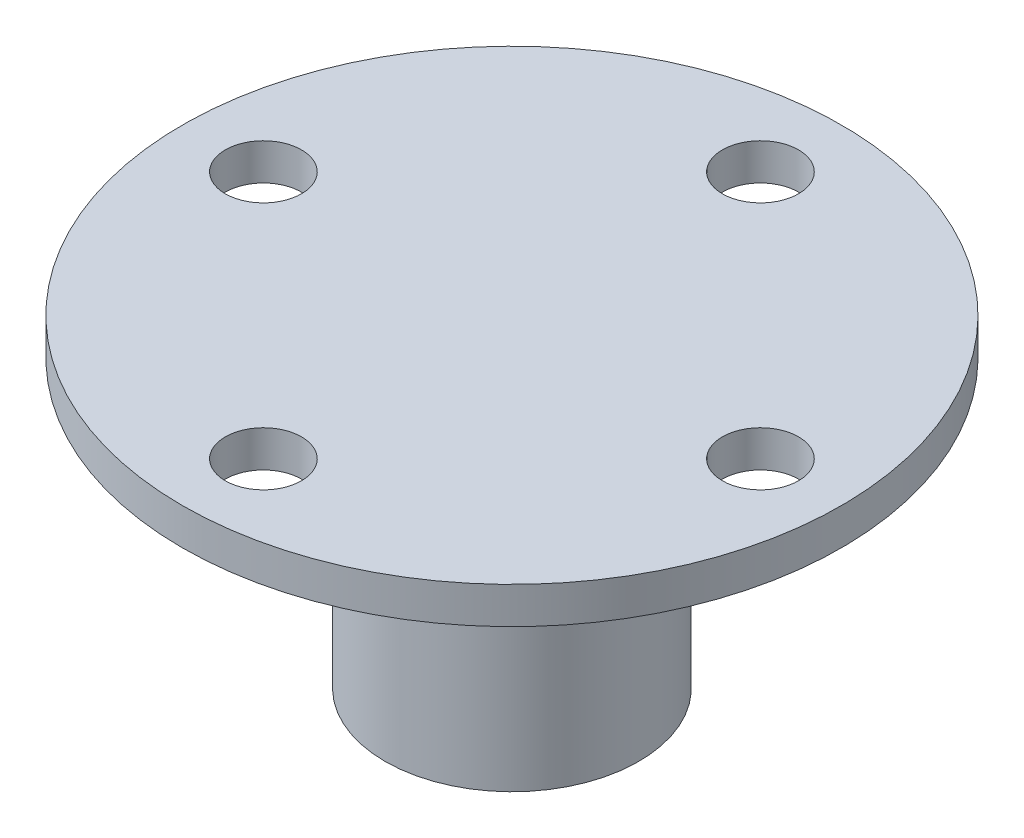
ISO-10303-21;
HEADER;
FILE_DESCRIPTION(('STEP AP214'),'2;1');
FILE_NAME('part.step','',(''),(''),'','','');
FILE_SCHEMA(('AUTOMOTIVE_DESIGN { 1 0 10303 214 1 1 1 1 }'));
ENDSEC;
DATA;
#1=APPLICATION_CONTEXT('core data for automotive mechanical design processes');
#2=APPLICATION_PROTOCOL_DEFINITION('international standard','automotive_design',2000,#1);
#3=PRODUCT_CONTEXT('',#1,'mechanical');
#4=PRODUCT('Part','Part','',(#3));
#5=PRODUCT_RELATED_PRODUCT_CATEGORY('part','',(#4));
#6=PRODUCT_DEFINITION_FORMATION('','',#4);
#7=PRODUCT_DEFINITION_CONTEXT('part definition',#1,'design');
#8=PRODUCT_DEFINITION('design','',#6,#7);
#9=PRODUCT_DEFINITION_SHAPE('','',#8);
#10=(LENGTH_UNIT() NAMED_UNIT(*) SI_UNIT(.MILLI.,.METRE.));
#11=(NAMED_UNIT(*) PLANE_ANGLE_UNIT() SI_UNIT($,.RADIAN.));
#12=(NAMED_UNIT(*) SI_UNIT($,.STERADIAN.) SOLID_ANGLE_UNIT());
#13=UNCERTAINTY_MEASURE_WITH_UNIT(LENGTH_MEASURE(1.E-05),#10,'distance_accuracy_value','');
#14=(GEOMETRIC_REPRESENTATION_CONTEXT(3) GLOBAL_UNCERTAINTY_ASSIGNED_CONTEXT((#13)) GLOBAL_UNIT_ASSIGNED_CONTEXT((#10,
#11,#12)) REPRESENTATION_CONTEXT('',''));
#15=CARTESIAN_POINT('',(0.,0.,0.));
#16=DIRECTION('',(0.,0.,1.));
#17=DIRECTION('',(1.,0.,0.));
#18=AXIS2_PLACEMENT_3D('',#15,#16,#17);
#19=CARTESIAN_POINT('',(0.,3.175,21.548));
#20=DIRECTION('',(0.,-1.,0.));
#21=DIRECTION('',(0.,0.,-1.));
#22=AXIS2_PLACEMENT_3D('',#19,#20,#21);
#23=CYLINDRICAL_SURFACE('',#22,3.302);
#24=CARTESIAN_POINT('',(0.,3.175,21.548));
#25=DIRECTION('',(0.,1.,0.));
#26=DIRECTION('',(0.,0.,1.));
#27=AXIS2_PLACEMENT_3D('',#24,#25,#26);
#28=CIRCLE('',#27,3.302);
#29=CARTESIAN_POINT('',(0.,3.175,24.85));
#30=VERTEX_POINT('',#29);
#31=EDGE_CURVE('E155',#30,#30,#28,.T.);
#32=ORIENTED_EDGE('',*,*,#31,.T.);
#33=EDGE_LOOP('',(#32));
#34=FACE_BOUND('',#33,.T.);
#35=CARTESIAN_POINT('',(0.,0.,21.548));
#36=DIRECTION('',(0.,1.,0.));
#37=DIRECTION('',(0.,0.,1.));
#38=AXIS2_PLACEMENT_3D('',#35,#36,#37);
#39=CIRCLE('',#38,3.302);
#40=CARTESIAN_POINT('',(0.,0.,24.85));
#41=VERTEX_POINT('',#40);
#42=EDGE_CURVE('E174',#41,#41,#39,.T.);
#43=ORIENTED_EDGE('',*,*,#42,.F.);
#44=EDGE_LOOP('',(#43));
#45=FACE_BOUND('',#44,.T.);
#46=ADVANCED_FACE('F46',(#34,#45),#23,.F.);
#47=CARTESIAN_POINT('',(-21.548,3.175,-1.50468879778784E-13));
#48=DIRECTION('',(0.,-1.,0.));
#49=DIRECTION('',(0.,0.,-1.));
#50=AXIS2_PLACEMENT_3D('',#47,#48,#49);
#51=CYLINDRICAL_SURFACE('',#50,3.302);
#52=CARTESIAN_POINT('',(-21.548,3.175,-1.50468879778784E-13));
#53=DIRECTION('',(0.,1.,0.));
#54=DIRECTION('',(0.,0.,1.));
#55=AXIS2_PLACEMENT_3D('',#52,#53,#54);
#56=CIRCLE('',#55,3.302);
#57=CARTESIAN_POINT('',(-21.548,3.175,3.30199999999985));
#58=VERTEX_POINT('',#57);
#59=EDGE_CURVE('E151',#58,#58,#56,.T.);
#60=ORIENTED_EDGE('',*,*,#59,.T.);
#61=EDGE_LOOP('',(#60));
#62=FACE_BOUND('',#61,.T.);
#63=CARTESIAN_POINT('',(-21.548,0.,-1.50468879778784E-13));
#64=DIRECTION('',(0.,1.,0.));
#65=DIRECTION('',(0.,0.,1.));
#66=AXIS2_PLACEMENT_3D('',#63,#64,#65);
#67=CIRCLE('',#66,3.302);
#68=CARTESIAN_POINT('',(-21.548,0.,3.30199999999985));
#69=VERTEX_POINT('',#68);
#70=EDGE_CURVE('E170',#69,#69,#67,.T.);
#71=ORIENTED_EDGE('',*,*,#70,.F.);
#72=EDGE_LOOP('',(#71));
#73=FACE_BOUND('',#72,.T.);
#74=ADVANCED_FACE('F197',(#62,#73),#51,.F.);
#75=CARTESIAN_POINT('',(2.25703319668175E-13,3.175,-21.548));
#76=DIRECTION('',(0.,-1.,0.));
#77=DIRECTION('',(0.,0.,-1.));
#78=AXIS2_PLACEMENT_3D('',#75,#76,#77);
#79=CYLINDRICAL_SURFACE('',#78,3.302);
#80=CARTESIAN_POINT('',(2.25703319668175E-13,3.175,-21.548));
#81=DIRECTION('',(0.,1.,0.));
#82=DIRECTION('',(0.,0.,1.));
#83=AXIS2_PLACEMENT_3D('',#80,#81,#82);
#84=CIRCLE('',#83,3.302);
#85=CARTESIAN_POINT('',(2.25703319668175E-13,3.175,-18.246));
#86=VERTEX_POINT('',#85);
#87=EDGE_CURVE('E146',#86,#86,#84,.T.);
#88=ORIENTED_EDGE('',*,*,#87,.T.);
#89=EDGE_LOOP('',(#88));
#90=FACE_BOUND('',#89,.T.);
#91=CARTESIAN_POINT('',(2.25703319668175E-13,0.,-21.548));
#92=DIRECTION('',(0.,1.,0.));
#93=DIRECTION('',(0.,0.,1.));
#94=AXIS2_PLACEMENT_3D('',#91,#92,#93);
#95=CIRCLE('',#94,3.302);
#96=CARTESIAN_POINT('',(2.25703319668175E-13,0.,-18.246));
#97=VERTEX_POINT('',#96);
#98=EDGE_CURVE('E166',#97,#97,#95,.T.);
#99=ORIENTED_EDGE('',*,*,#98,.F.);
#100=EDGE_LOOP('',(#99));
#101=FACE_BOUND('',#100,.T.);
#102=ADVANCED_FACE('F203',(#90,#101),#79,.F.);
#103=CARTESIAN_POINT('',(21.548,3.175,0.));
#104=DIRECTION('',(0.,-1.,0.));
#105=DIRECTION('',(0.,0.,-1.));
#106=AXIS2_PLACEMENT_3D('',#103,#104,#105);
#107=CYLINDRICAL_SURFACE('',#106,3.302);
#108=CARTESIAN_POINT('',(21.548,3.175,0.));
#109=DIRECTION('',(0.,1.,0.));
#110=DIRECTION('',(0.,0.,1.));
#111=AXIS2_PLACEMENT_3D('',#108,#109,#110);
#112=CIRCLE('',#111,3.302);
#113=CARTESIAN_POINT('',(21.548,3.175,3.302));
#114=VERTEX_POINT('',#113);
#115=EDGE_CURVE('E142',#114,#114,#112,.T.);
#116=ORIENTED_EDGE('',*,*,#115,.T.);
#117=EDGE_LOOP('',(#116));
#118=FACE_BOUND('',#117,.T.);
#119=CARTESIAN_POINT('',(21.548,0.,0.));
#120=DIRECTION('',(0.,1.,0.));
#121=DIRECTION('',(0.,0.,1.));
#122=AXIS2_PLACEMENT_3D('',#119,#120,#121);
#123=CIRCLE('',#122,3.302);
#124=CARTESIAN_POINT('',(21.548,0.,3.302));
#125=VERTEX_POINT('',#124);
#126=EDGE_CURVE('E136',#125,#125,#123,.T.);
#127=ORIENTED_EDGE('',*,*,#126,.F.);
#128=EDGE_LOOP('',(#127));
#129=FACE_BOUND('',#128,.T.);
#130=ADVANCED_FACE('F211',(#118,#129),#107,.F.);
#131=CARTESIAN_POINT('',(0.,3.175,0.));
#132=DIRECTION('',(0.,-1.,0.));
#133=DIRECTION('',(0.,0.,-1.));
#134=AXIS2_PLACEMENT_3D('',#131,#132,#133);
#135=CYLINDRICAL_SURFACE('',#134,28.575);
#136=CARTESIAN_POINT('',(0.,3.175,0.));
#137=DIRECTION('',(0.,1.,0.));
#138=DIRECTION('',(0.,0.,1.));
#139=AXIS2_PLACEMENT_3D('',#136,#137,#138);
#140=CIRCLE('',#139,28.575);
#141=CARTESIAN_POINT('',(0.,3.175,28.575));
#142=VERTEX_POINT('',#141);
#143=EDGE_CURVE('E159',#142,#142,#140,.T.);
#144=ORIENTED_EDGE('',*,*,#143,.F.);
#145=EDGE_LOOP('',(#144));
#146=FACE_BOUND('',#145,.T.);
#147=CARTESIAN_POINT('',(0.,0.,0.));
#148=DIRECTION('',(0.,1.,0.));
#149=DIRECTION('',(0.,0.,1.));
#150=AXIS2_PLACEMENT_3D('',#147,#148,#149);
#151=CIRCLE('',#150,28.575);
#152=CARTESIAN_POINT('',(0.,0.,28.575));
#153=VERTEX_POINT('',#152);
#154=EDGE_CURVE('E147',#153,#153,#151,.T.);
#155=ORIENTED_EDGE('',*,*,#154,.T.);
#156=EDGE_LOOP('',(#155));
#157=FACE_BOUND('',#156,.T.);
#158=ADVANCED_FACE('F208',(#146,#157),#135,.T.);
#159=CARTESIAN_POINT('',(0.,3.175,0.));
#160=DIRECTION('',(0.,1.,0.));
#161=DIRECTION('',(0.,0.,1.));
#162=AXIS2_PLACEMENT_3D('',#159,#160,#161);
#163=PLANE('',#162);
#164=ORIENTED_EDGE('',*,*,#115,.F.);
#165=EDGE_LOOP('',(#164));
#166=FACE_BOUND('',#165,.T.);
#167=ORIENTED_EDGE('',*,*,#87,.F.);
#168=EDGE_LOOP('',(#167));
#169=FACE_BOUND('',#168,.T.);
#170=ORIENTED_EDGE('',*,*,#59,.F.);
#171=EDGE_LOOP('',(#170));
#172=FACE_BOUND('',#171,.T.);
#173=ORIENTED_EDGE('',*,*,#31,.F.);
#174=EDGE_LOOP('',(#173));
#175=FACE_BOUND('',#174,.T.);
#176=ORIENTED_EDGE('',*,*,#143,.T.);
#177=EDGE_LOOP('',(#176));
#178=FACE_BOUND('',#177,.T.);
#179=ADVANCED_FACE('F218',(#166,#169,#172,#175,#178),#163,.T.);
#180=CARTESIAN_POINT('',(0.,0.,0.));
#181=DIRECTION('',(0.,1.,0.));
#182=DIRECTION('',(0.,0.,1.));
#183=AXIS2_PLACEMENT_3D('',#180,#181,#182);
#184=PLANE('',#183);
#185=CARTESIAN_POINT('',(0.,0.,0.));
#186=DIRECTION('',(0.,1.,0.));
#187=DIRECTION('',(0.,0.,1.));
#188=AXIS2_PLACEMENT_3D('',#185,#186,#187);
#189=CIRCLE('',#188,16.);
#190=CARTESIAN_POINT('',(0.,0.,16.));
#191=VERTEX_POINT('',#190);
#192=EDGE_CURVE('E55',#191,#191,#189,.T.);
#193=ORIENTED_EDGE('',*,*,#192,.T.);
#194=EDGE_LOOP('',(#193));
#195=FACE_BOUND('',#194,.T.);
#196=ORIENTED_EDGE('',*,*,#126,.T.);
#197=EDGE_LOOP('',(#196));
#198=FACE_BOUND('',#197,.T.);
#199=ORIENTED_EDGE('',*,*,#98,.T.);
#200=EDGE_LOOP('',(#199));
#201=FACE_BOUND('',#200,.T.);
#202=ORIENTED_EDGE('',*,*,#70,.T.);
#203=EDGE_LOOP('',(#202));
#204=FACE_BOUND('',#203,.T.);
#205=ORIENTED_EDGE('',*,*,#42,.T.);
#206=EDGE_LOOP('',(#205));
#207=FACE_BOUND('',#206,.T.);
#208=ORIENTED_EDGE('',*,*,#154,.F.);
#209=EDGE_LOOP('',(#208));
#210=FACE_BOUND('',#209,.T.);
#211=ADVANCED_FACE('F184',(#195,#198,#201,#204,#207,#210),#184,.F.);
#212=CARTESIAN_POINT('',(0.,-24.825,0.));
#213=DIRECTION('',(0.,1.,0.));
#214=DIRECTION('',(0.,0.,1.));
#215=AXIS2_PLACEMENT_3D('',#212,#213,#214);
#216=CYLINDRICAL_SURFACE('',#215,6.);
#217=CARTESIAN_POINT('',(0.,0.,0.));
#218=DIRECTION('',(0.,1.,0.));
#219=DIRECTION('',(0.,0.,1.));
#220=AXIS2_PLACEMENT_3D('',#217,#218,#219);
#221=CIRCLE('',#220,6.);
#222=CARTESIAN_POINT('',(-2.5857864376269,0.,5.4142135623731));
#223=VERTEX_POINT('',#222);
#224=CARTESIAN_POINT('',(-5.41421356237311,0.,2.58578643762691));
#225=VERTEX_POINT('',#224);
#226=EDGE_CURVE('E125',#223,#225,#221,.T.);
#227=ORIENTED_EDGE('',*,*,#226,.T.);
#228=DIRECTION('',(0.,1.,0.));
#229=VECTOR('',#228,1.);
#230=CARTESIAN_POINT('',(-5.41421356237311,-24.825,2.58578643762691));
#231=LINE('',#230,#229);
#232=CARTESIAN_POINT('',(-5.41421356237311,-24.825,2.58578643762691));
#233=VERTEX_POINT('',#232);
#234=EDGE_CURVE('E112',#233,#225,#231,.T.);
#235=ORIENTED_EDGE('',*,*,#234,.F.);
#236=CARTESIAN_POINT('',(0.,-24.825,0.));
#237=DIRECTION('',(0.,1.,0.));
#238=DIRECTION('',(0.,0.,1.));
#239=AXIS2_PLACEMENT_3D('',#236,#237,#238);
#240=CIRCLE('',#239,6.);
#241=CARTESIAN_POINT('',(-2.5857864376269,-24.825,5.4142135623731));
#242=VERTEX_POINT('',#241);
#243=EDGE_CURVE('E91',#242,#233,#240,.T.);
#244=ORIENTED_EDGE('',*,*,#243,.F.);
#245=DIRECTION('',(0.,1.,0.));
#246=VECTOR('',#245,1.);
#247=CARTESIAN_POINT('',(-2.5857864376269,-24.825,5.4142135623731));
#248=LINE('',#247,#246);
#249=EDGE_CURVE('E102',#242,#223,#248,.T.);
#250=ORIENTED_EDGE('',*,*,#249,.T.);
#251=EDGE_LOOP('',(#227,#235,#244,#250));
#252=FACE_BOUND('',#251,.T.);
#253=ADVANCED_FACE('F111',(#252),#216,.F.);
#254=CARTESIAN_POINT('',(-1.41421356237311,-24.825,-1.4142135623731));
#255=DIRECTION('',(0.707106781186548,0.,0.707106781186547));
#256=DIRECTION('',(0.707106781186547,0.,-0.707106781186548));
#257=AXIS2_PLACEMENT_3D('',#254,#255,#256);
#258=PLANE('',#257);
#259=DIRECTION('',(0.707106781186547,0.,-0.707106781186548));
#260=VECTOR('',#259,1.);
#261=CARTESIAN_POINT('',(-1.41421356237311,0.,-1.4142135623731));
#262=LINE('',#261,#260);
#263=CARTESIAN_POINT('',(-6.71751442127221,0.,3.88908729652601));
#264=VERTEX_POINT('',#263);
#265=EDGE_CURVE('E62',#264,#225,#262,.T.);
#266=ORIENTED_EDGE('',*,*,#265,.F.);
#267=DIRECTION('',(0.,1.,0.));
#268=VECTOR('',#267,1.);
#269=CARTESIAN_POINT('',(-6.71751442127221,-24.825,3.88908729652601));
#270=LINE('',#269,#268);
#271=CARTESIAN_POINT('',(-6.71751442127221,-24.825,3.88908729652601));
#272=VERTEX_POINT('',#271);
#273=EDGE_CURVE('E137',#272,#264,#270,.T.);
#274=ORIENTED_EDGE('',*,*,#273,.F.);
#275=DIRECTION('',(0.707106781186547,0.,-0.707106781186548));
#276=VECTOR('',#275,1.);
#277=CARTESIAN_POINT('',(-1.41421356237311,-24.825,-1.4142135623731));
#278=LINE('',#277,#276);
#279=EDGE_CURVE('E109',#272,#233,#278,.T.);
#280=ORIENTED_EDGE('',*,*,#279,.T.);
#281=ORIENTED_EDGE('',*,*,#234,.T.);
#282=EDGE_LOOP('',(#266,#274,#280,#281));
#283=FACE_BOUND('',#282,.T.);
#284=ADVANCED_FACE('F238',(#283),#258,.T.);
#285=CARTESIAN_POINT('',(-5.30330085889909,-24.825,5.30330085889912));
#286=DIRECTION('',(-0.707106781186546,0.,0.707106781186549));
#287=DIRECTION('',(0.707106781186549,0.,0.707106781186546));
#288=AXIS2_PLACEMENT_3D('',#285,#286,#287);
#289=PLANE('',#288);
#290=DIRECTION('',(0.707106781186549,0.,0.707106781186546));
#291=VECTOR('',#290,1.);
#292=CARTESIAN_POINT('',(-5.30330085889909,0.,5.30330085889912));
#293=LINE('',#292,#291);
#294=CARTESIAN_POINT('',(-3.88908729652601,0.,6.7175144212722));
#295=VERTEX_POINT('',#294);
#296=EDGE_CURVE('E67',#264,#295,#293,.T.);
#297=ORIENTED_EDGE('',*,*,#296,.T.);
#298=DIRECTION('',(0.,1.,0.));
#299=VECTOR('',#298,1.);
#300=CARTESIAN_POINT('',(-3.88908729652601,-24.825,6.7175144212722));
#301=LINE('',#300,#299);
#302=CARTESIAN_POINT('',(-3.88908729652601,-24.825,6.7175144212722));
#303=VERTEX_POINT('',#302);
#304=EDGE_CURVE('E108',#303,#295,#301,.T.);
#305=ORIENTED_EDGE('',*,*,#304,.F.);
#306=DIRECTION('',(0.707106781186549,0.,0.707106781186546));
#307=VECTOR('',#306,1.);
#308=CARTESIAN_POINT('',(-5.30330085889909,-24.825,5.30330085889912));
#309=LINE('',#308,#307);
#310=EDGE_CURVE('E94',#272,#303,#309,.T.);
#311=ORIENTED_EDGE('',*,*,#310,.F.);
#312=ORIENTED_EDGE('',*,*,#273,.T.);
#313=EDGE_LOOP('',(#297,#305,#311,#312));
#314=FACE_BOUND('',#313,.T.);
#315=ADVANCED_FACE('F245',(#314),#289,.F.);
#316=CARTESIAN_POINT('',(0.,-24.825,0.));
#317=DIRECTION('',(0.,1.,0.));
#318=DIRECTION('',(0.,0.,1.));
#319=AXIS2_PLACEMENT_3D('',#316,#317,#318);
#320=CYLINDRICAL_SURFACE('',#319,11.);
#321=CARTESIAN_POINT('',(0.,-5.,0.));
#322=DIRECTION('',(0.,1.,0.));
#323=DIRECTION('',(0.,0.,1.));
#324=AXIS2_PLACEMENT_3D('',#321,#322,#323);
#325=CIRCLE('',#324,11.);
#326=CARTESIAN_POINT('',(0.,-5.,11.));
#327=VERTEX_POINT('',#326);
#328=EDGE_CURVE('E11',#327,#327,#325,.F.);
#329=ORIENTED_EDGE('',*,*,#328,.T.);
#330=EDGE_LOOP('',(#329));
#331=FACE_BOUND('',#330,.T.);
#332=CARTESIAN_POINT('',(0.,-24.825,0.));
#333=DIRECTION('',(0.,1.,0.));
#334=DIRECTION('',(0.,0.,1.));
#335=AXIS2_PLACEMENT_3D('',#332,#333,#334);
#336=CIRCLE('',#335,11.);
#337=CARTESIAN_POINT('',(0.,-24.825,11.));
#338=VERTEX_POINT('',#337);
#339=EDGE_CURVE('E115',#338,#338,#336,.T.);
#340=ORIENTED_EDGE('',*,*,#339,.T.);
#341=EDGE_LOOP('',(#340));
#342=FACE_BOUND('',#341,.T.);
#343=ADVANCED_FACE('F244',(#331,#342),#320,.T.);
#344=CARTESIAN_POINT('',(1.4142135623731,-24.825,1.4142135623731));
#345=DIRECTION('',(0.707106781186547,0.,0.707106781186548));
#346=DIRECTION('',(0.707106781186548,0.,-0.707106781186547));
#347=AXIS2_PLACEMENT_3D('',#344,#345,#346);
#348=PLANE('',#347);
#349=DIRECTION('',(0.707106781186548,0.,-0.707106781186547));
#350=VECTOR('',#349,1.);
#351=CARTESIAN_POINT('',(1.4142135623731,0.,1.4142135623731));
#352=LINE('',#351,#350);
#353=EDGE_CURVE('E104',#295,#223,#352,.T.);
#354=ORIENTED_EDGE('',*,*,#353,.T.);
#355=ORIENTED_EDGE('',*,*,#249,.F.);
#356=DIRECTION('',(0.707106781186548,0.,-0.707106781186547));
#357=VECTOR('',#356,1.);
#358=CARTESIAN_POINT('',(1.4142135623731,-24.825,1.4142135623731));
#359=LINE('',#358,#357);
#360=EDGE_CURVE('E86',#303,#242,#359,.T.);
#361=ORIENTED_EDGE('',*,*,#360,.F.);
#362=ORIENTED_EDGE('',*,*,#304,.T.);
#363=EDGE_LOOP('',(#354,#355,#361,#362));
#364=FACE_BOUND('',#363,.T.);
#365=ADVANCED_FACE('F103',(#364),#348,.F.);
#366=CARTESIAN_POINT('',(0.,-24.825,0.));
#367=DIRECTION('',(0.,1.,0.));
#368=DIRECTION('',(0.,0.,1.));
#369=AXIS2_PLACEMENT_3D('',#366,#367,#368);
#370=PLANE('',#369);
#371=ORIENTED_EDGE('',*,*,#339,.F.);
#372=EDGE_LOOP('',(#371));
#373=FACE_BOUND('',#372,.T.);
#374=ORIENTED_EDGE('',*,*,#243,.T.);
#375=ORIENTED_EDGE('',*,*,#279,.F.);
#376=ORIENTED_EDGE('',*,*,#310,.T.);
#377=ORIENTED_EDGE('',*,*,#360,.T.);
#378=EDGE_LOOP('',(#374,#375,#376,#377));
#379=FACE_BOUND('',#378,.T.);
#380=ADVANCED_FACE('F88',(#373,#379),#370,.F.);
#381=ORIENTED_EDGE('',*,*,#226,.F.);
#382=ORIENTED_EDGE('',*,*,#353,.F.);
#383=ORIENTED_EDGE('',*,*,#296,.F.);
#384=ORIENTED_EDGE('',*,*,#265,.T.);
#385=EDGE_LOOP('',(#381,#382,#383,#384));
#386=FACE_BOUND('',#385,.T.);
#387=ADVANCED_FACE('F188',(#386),#184,.F.);
#388=CARTESIAN_POINT('',(0.,-5.,0.));
#389=DIRECTION('',(0.,1.,0.));
#390=DIRECTION('',(0.,0.,1.));
#391=AXIS2_PLACEMENT_3D('',#388,#389,#390);
#392=TOROIDAL_SURFACE('',#391,16.,5.);
#393=ORIENTED_EDGE('',*,*,#328,.F.);
#394=EDGE_LOOP('',(#393));
#395=FACE_BOUND('',#394,.T.);
#396=ORIENTED_EDGE('',*,*,#192,.F.);
#397=EDGE_LOOP('',(#396));
#398=FACE_BOUND('',#397,.T.);
#399=ADVANCED_FACE('F48',(#395,#398),#392,.F.);
#400=CLOSED_SHELL('',(#46,#74,#102,#130,#158,#179,#211,#253,#284,#315,#343,#365,#380,#387,#399));
#401=MANIFOLD_SOLID_BREP('B2',#400);
#402=ADVANCED_BREP_SHAPE_REPRESENTATION('',(#18,#401),#14);
#403=SHAPE_DEFINITION_REPRESENTATION(#9,#402);
ENDSEC;
END-ISO-10303-21;
